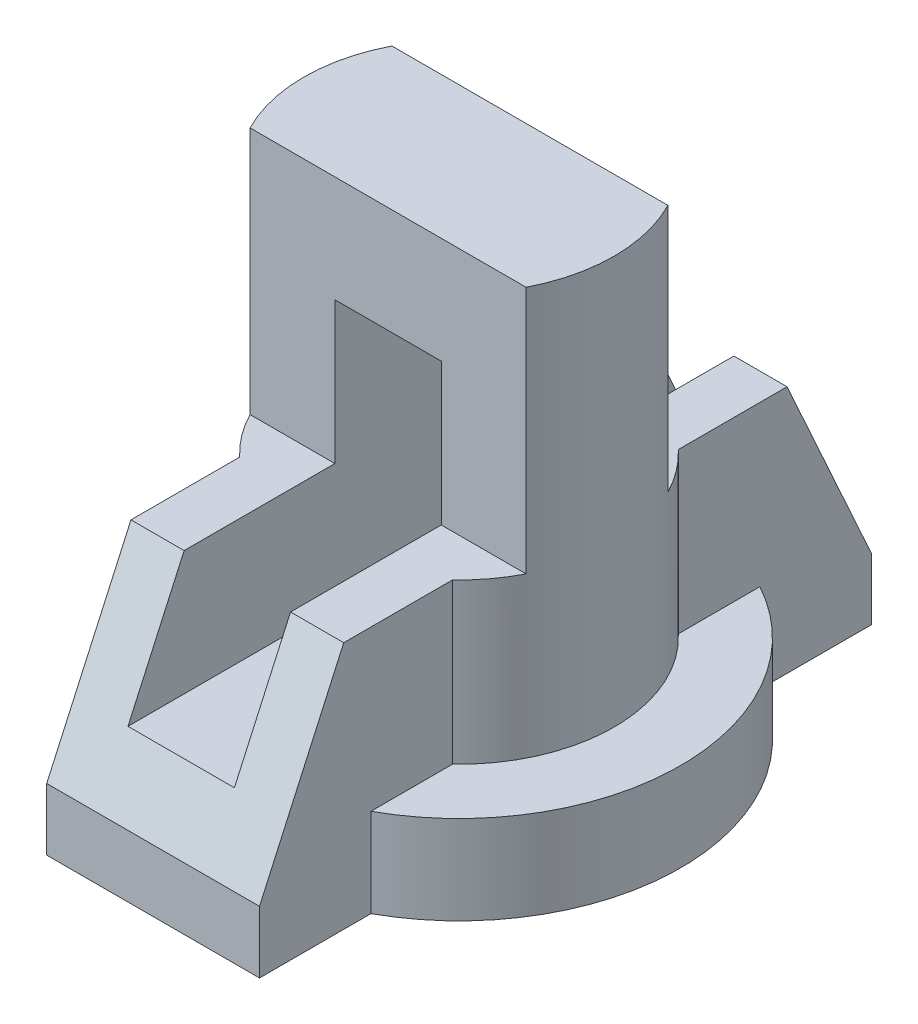
ISO-10303-21;
HEADER;
FILE_DESCRIPTION(('STEP AP214'),'2;1');
FILE_NAME('part.step','',(''),(''),'','','');
FILE_SCHEMA(('AUTOMOTIVE_DESIGN { 1 0 10303 214 1 1 1 1 }'));
ENDSEC;
DATA;
#1=APPLICATION_CONTEXT('core data for automotive mechanical design processes');
#2=APPLICATION_PROTOCOL_DEFINITION('international standard','automotive_design',2000,#1);
#3=PRODUCT_CONTEXT('',#1,'mechanical');
#4=PRODUCT('Part','Part','',(#3));
#5=PRODUCT_RELATED_PRODUCT_CATEGORY('part','',(#4));
#6=PRODUCT_DEFINITION_FORMATION('','',#4);
#7=PRODUCT_DEFINITION_CONTEXT('part definition',#1,'design');
#8=PRODUCT_DEFINITION('design','',#6,#7);
#9=PRODUCT_DEFINITION_SHAPE('','',#8);
#10=(LENGTH_UNIT() NAMED_UNIT(*) SI_UNIT(.MILLI.,.METRE.));
#11=(NAMED_UNIT(*) PLANE_ANGLE_UNIT() SI_UNIT($,.RADIAN.));
#12=(NAMED_UNIT(*) SI_UNIT($,.STERADIAN.) SOLID_ANGLE_UNIT());
#13=UNCERTAINTY_MEASURE_WITH_UNIT(LENGTH_MEASURE(1.E-05),#10,'distance_accuracy_value','');
#14=(GEOMETRIC_REPRESENTATION_CONTEXT(3) GLOBAL_UNCERTAINTY_ASSIGNED_CONTEXT((#13)) GLOBAL_UNIT_ASSIGNED_CONTEXT((#10,
#11,#12)) REPRESENTATION_CONTEXT('',''));
#15=CARTESIAN_POINT('',(0.,0.,0.));
#16=DIRECTION('',(0.,0.,1.));
#17=DIRECTION('',(1.,0.,0.));
#18=AXIS2_PLACEMENT_3D('',#15,#16,#17);
#19=CARTESIAN_POINT('',(0.,28.,0.));
#20=DIRECTION('',(0.,1.,0.));
#21=DIRECTION('',(0.,0.,1.));
#22=AXIS2_PLACEMENT_3D('',#19,#20,#21);
#23=PLANE('',#22);
#24=DIRECTION('',(0.,0.,-1.));
#25=VECTOR('',#24,1.);
#26=CARTESIAN_POINT('',(6.,28.,0.));
#27=LINE('',#26,#25);
#28=CARTESIAN_POINT('',(6.,28.,-8.));
#29=VERTEX_POINT('',#28);
#30=CARTESIAN_POINT('',(6.,28.,-25.));
#31=VERTEX_POINT('',#30);
#32=EDGE_CURVE('E356',#29,#31,#27,.T.);
#33=ORIENTED_EDGE('',*,*,#32,.F.);
#34=DIRECTION('',(-1.,0.,0.));
#35=VECTOR('',#34,1.);
#36=CARTESIAN_POINT('',(15.5643824162734,28.,-8.));
#37=LINE('',#36,#35);
#38=CARTESIAN_POINT('',(15.5643824162734,28.,-8.));
#39=VERTEX_POINT('',#38);
#40=EDGE_CURVE('E255',#39,#29,#37,.T.);
#41=ORIENTED_EDGE('',*,*,#40,.F.);
#42=CARTESIAN_POINT('',(0.,28.,0.));
#43=DIRECTION('',(0.,1.,0.));
#44=DIRECTION('',(0.,0.,1.));
#45=AXIS2_PLACEMENT_3D('',#42,#43,#44);
#46=CIRCLE('',#45,17.5);
#47=CARTESIAN_POINT('',(12.,28.,-12.737739202857));
#48=VERTEX_POINT('',#47);
#49=EDGE_CURVE('E241',#39,#48,#46,.T.);
#50=ORIENTED_EDGE('',*,*,#49,.T.);
#51=DIRECTION('',(0.,0.,1.));
#52=VECTOR('',#51,1.);
#53=CARTESIAN_POINT('',(12.,28.,25.));
#54=LINE('',#53,#52);
#55=CARTESIAN_POINT('',(12.,28.,-25.));
#56=VERTEX_POINT('',#55);
#57=EDGE_CURVE('E339',#56,#48,#54,.T.);
#58=ORIENTED_EDGE('',*,*,#57,.F.);
#59=DIRECTION('',(-1.,0.,0.));
#60=VECTOR('',#59,1.);
#61=CARTESIAN_POINT('',(12.,28.,-25.));
#62=LINE('',#61,#60);
#63=EDGE_CURVE('E304',#56,#31,#62,.T.);
#64=ORIENTED_EDGE('',*,*,#63,.T.);
#65=EDGE_LOOP('',(#33,#41,#50,#58,#64));
#66=FACE_BOUND('',#65,.T.);
#67=ADVANCED_FACE('F33',(#66),#23,.T.);
#68=DIRECTION('',(0.,0.,-1.));
#69=VECTOR('',#68,1.);
#70=CARTESIAN_POINT('',(6.,28.,0.));
#71=LINE('',#70,#69);
#72=CARTESIAN_POINT('',(6.,28.,25.));
#73=VERTEX_POINT('',#72);
#74=CARTESIAN_POINT('',(6.,28.,8.));
#75=VERTEX_POINT('',#74);
#76=EDGE_CURVE('E364',#73,#75,#71,.T.);
#77=ORIENTED_EDGE('',*,*,#76,.F.);
#78=DIRECTION('',(-1.,0.,0.));
#79=VECTOR('',#78,1.);
#80=CARTESIAN_POINT('',(12.,28.,25.));
#81=LINE('',#80,#79);
#82=CARTESIAN_POINT('',(12.,28.,25.));
#83=VERTEX_POINT('',#82);
#84=EDGE_CURVE('E308',#83,#73,#81,.T.);
#85=ORIENTED_EDGE('',*,*,#84,.F.);
#86=CARTESIAN_POINT('',(12.,28.,12.737739202857));
#87=VERTEX_POINT('',#86);
#88=EDGE_CURVE('E342',#87,#83,#54,.T.);
#89=ORIENTED_EDGE('',*,*,#88,.F.);
#90=CARTESIAN_POINT('',(15.5643824162734,28.,8.));
#91=VERTEX_POINT('',#90);
#92=EDGE_CURVE('E240',#87,#91,#46,.T.);
#93=ORIENTED_EDGE('',*,*,#92,.T.);
#94=DIRECTION('',(1.,0.,0.));
#95=VECTOR('',#94,1.);
#96=CARTESIAN_POINT('',(-15.5643824162734,28.,8.));
#97=LINE('',#96,#95);
#98=EDGE_CURVE('E263',#75,#91,#97,.T.);
#99=ORIENTED_EDGE('',*,*,#98,.F.);
#100=EDGE_LOOP('',(#77,#85,#89,#93,#99));
#101=FACE_BOUND('',#100,.T.);
#102=ADVANCED_FACE('F438',(#101),#23,.T.);
#103=CARTESIAN_POINT('',(0.,10.,0.));
#104=DIRECTION('',(0.,-1.,0.));
#105=DIRECTION('',(0.,0.,-1.));
#106=AXIS2_PLACEMENT_3D('',#103,#104,#105);
#107=CYLINDRICAL_SURFACE('',#106,25.);
#108=DIRECTION('',(0.,-1.,0.));
#109=VECTOR('',#108,1.);
#110=CARTESIAN_POINT('',(-12.,10.,21.9317121994613));
#111=LINE('',#110,#109);
#112=CARTESIAN_POINT('',(-12.,10.,21.9317121994613));
#113=VERTEX_POINT('',#112);
#114=CARTESIAN_POINT('',(-12.,0.,21.9317121994613));
#115=VERTEX_POINT('',#114);
#116=EDGE_CURVE('E283',#113,#115,#111,.T.);
#117=ORIENTED_EDGE('',*,*,#116,.F.);
#118=CARTESIAN_POINT('',(0.,10.,0.));
#119=DIRECTION('',(0.,1.,0.));
#120=DIRECTION('',(0.,0.,1.));
#121=AXIS2_PLACEMENT_3D('',#118,#119,#120);
#122=CIRCLE('',#121,25.);
#123=CARTESIAN_POINT('',(-12.,10.,-21.9317121994613));
#124=VERTEX_POINT('',#123);
#125=EDGE_CURVE('E228',#124,#113,#122,.T.);
#126=ORIENTED_EDGE('',*,*,#125,.F.);
#127=DIRECTION('',(0.,-1.,0.));
#128=VECTOR('',#127,1.);
#129=CARTESIAN_POINT('',(-12.,10.,-21.9317121994613));
#130=LINE('',#129,#128);
#131=CARTESIAN_POINT('',(-12.,0.,-21.9317121994613));
#132=VERTEX_POINT('',#131);
#133=EDGE_CURVE('E290',#132,#124,#130,.F.);
#134=ORIENTED_EDGE('',*,*,#133,.F.);
#135=CARTESIAN_POINT('',(0.,0.,0.));
#136=DIRECTION('',(0.,1.,0.));
#137=DIRECTION('',(0.,0.,1.));
#138=AXIS2_PLACEMENT_3D('',#135,#136,#137);
#139=CIRCLE('',#138,25.);
#140=EDGE_CURVE('E229',#132,#115,#139,.T.);
#141=ORIENTED_EDGE('',*,*,#140,.T.);
#142=EDGE_LOOP('',(#117,#126,#134,#141));
#143=FACE_BOUND('',#142,.T.);
#144=ADVANCED_FACE('F464',(#143),#107,.T.);
#145=CARTESIAN_POINT('',(0.,10.,0.));
#146=DIRECTION('',(0.,1.,0.));
#147=DIRECTION('',(0.,0.,1.));
#148=AXIS2_PLACEMENT_3D('',#145,#146,#147);
#149=PLANE('',#148);
#150=ORIENTED_EDGE('',*,*,#125,.T.);
#151=DIRECTION('',(0.,0.,-1.));
#152=VECTOR('',#151,1.);
#153=CARTESIAN_POINT('',(-12.,10.,0.));
#154=LINE('',#153,#152);
#155=CARTESIAN_POINT('',(-12.,10.,12.737739202857));
#156=VERTEX_POINT('',#155);
#157=EDGE_CURVE('E286',#113,#156,#154,.T.);
#158=ORIENTED_EDGE('',*,*,#157,.T.);
#159=CARTESIAN_POINT('',(0.,10.,0.));
#160=DIRECTION('',(0.,1.,0.));
#161=DIRECTION('',(0.,0.,1.));
#162=AXIS2_PLACEMENT_3D('',#159,#160,#161);
#163=CIRCLE('',#162,17.5);
#164=CARTESIAN_POINT('',(-12.,10.,-12.737739202857));
#165=VERTEX_POINT('',#164);
#166=EDGE_CURVE('E233',#165,#156,#163,.T.);
#167=ORIENTED_EDGE('',*,*,#166,.F.);
#168=EDGE_CURVE('E293',#165,#124,#154,.T.);
#169=ORIENTED_EDGE('',*,*,#168,.T.);
#170=EDGE_LOOP('',(#150,#158,#167,#169));
#171=FACE_BOUND('',#170,.T.);
#172=ADVANCED_FACE('F460',(#171),#149,.T.);
#173=CARTESIAN_POINT('',(0.,28.,0.));
#174=DIRECTION('',(0.,-1.,0.));
#175=DIRECTION('',(0.,0.,-1.));
#176=AXIS2_PLACEMENT_3D('',#173,#174,#175);
#177=CYLINDRICAL_SURFACE('',#176,17.5);
#178=DIRECTION('',(0.,-1.,0.));
#179=VECTOR('',#178,1.);
#180=CARTESIAN_POINT('',(-12.,28.,12.737739202857));
#181=LINE('',#180,#179);
#182=CARTESIAN_POINT('',(-12.,28.,12.737739202857));
#183=VERTEX_POINT('',#182);
#184=EDGE_CURVE('E287',#183,#156,#181,.T.);
#185=ORIENTED_EDGE('',*,*,#184,.F.);
#186=CARTESIAN_POINT('',(-15.5643824162734,28.,8.));
#187=VERTEX_POINT('',#186);
#188=EDGE_CURVE('E236',#187,#183,#46,.T.);
#189=ORIENTED_EDGE('',*,*,#188,.F.);
#190=DIRECTION('',(0.,-1.,0.));
#191=VECTOR('',#190,1.);
#192=CARTESIAN_POINT('',(-15.5643824162734,56.,8.));
#193=LINE('',#192,#191);
#194=CARTESIAN_POINT('',(-15.5643824162734,56.,8.));
#195=VERTEX_POINT('',#194);
#196=EDGE_CURVE('E242',#195,#187,#193,.T.);
#197=ORIENTED_EDGE('',*,*,#196,.F.);
#198=CARTESIAN_POINT('',(0.,56.,0.));
#199=DIRECTION('',(0.,1.,0.));
#200=DIRECTION('',(0.,0.,1.));
#201=AXIS2_PLACEMENT_3D('',#198,#199,#200);
#202=CIRCLE('',#201,17.5);
#203=CARTESIAN_POINT('',(-15.5643824162734,56.,-8.));
#204=VERTEX_POINT('',#203);
#205=EDGE_CURVE('E258',#204,#195,#202,.T.);
#206=ORIENTED_EDGE('',*,*,#205,.F.);
#207=DIRECTION('',(0.,-1.,0.));
#208=VECTOR('',#207,1.);
#209=CARTESIAN_POINT('',(-15.5643824162734,56.,-8.));
#210=LINE('',#209,#208);
#211=CARTESIAN_POINT('',(-15.5643824162734,28.,-8.));
#212=VERTEX_POINT('',#211);
#213=EDGE_CURVE('E251',#204,#212,#210,.T.);
#214=ORIENTED_EDGE('',*,*,#213,.T.);
#215=CARTESIAN_POINT('',(-12.,28.,-12.737739202857));
#216=VERTEX_POINT('',#215);
#217=EDGE_CURVE('E239',#216,#212,#46,.T.);
#218=ORIENTED_EDGE('',*,*,#217,.F.);
#219=DIRECTION('',(0.,-1.,0.));
#220=VECTOR('',#219,1.);
#221=CARTESIAN_POINT('',(-12.,28.,-12.737739202857));
#222=LINE('',#221,#220);
#223=EDGE_CURVE('E295',#165,#216,#222,.F.);
#224=ORIENTED_EDGE('',*,*,#223,.F.);
#225=ORIENTED_EDGE('',*,*,#166,.T.);
#226=EDGE_LOOP('',(#185,#189,#197,#206,#214,#218,#224,#225));
#227=FACE_BOUND('',#226,.T.);
#228=ADVANCED_FACE('F455',(#227),#177,.T.);
#229=DIRECTION('',(0.,0.,1.));
#230=VECTOR('',#229,1.);
#231=CARTESIAN_POINT('',(-6.,28.,0.));
#232=LINE('',#231,#230);
#233=CARTESIAN_POINT('',(-6.,28.,-25.));
#234=VERTEX_POINT('',#233);
#235=CARTESIAN_POINT('',(-6.,28.,-8.));
#236=VERTEX_POINT('',#235);
#237=EDGE_CURVE('E370',#234,#236,#232,.T.);
#238=ORIENTED_EDGE('',*,*,#237,.F.);
#239=CARTESIAN_POINT('',(-12.,28.,-25.));
#240=VERTEX_POINT('',#239);
#241=EDGE_CURVE('E307',#234,#240,#62,.T.);
#242=ORIENTED_EDGE('',*,*,#241,.T.);
#243=DIRECTION('',(0.,0.,1.));
#244=VECTOR('',#243,1.);
#245=CARTESIAN_POINT('',(-12.,28.,25.));
#246=LINE('',#245,#244);
#247=EDGE_CURVE('E323',#240,#216,#246,.T.);
#248=ORIENTED_EDGE('',*,*,#247,.T.);
#249=ORIENTED_EDGE('',*,*,#217,.T.);
#250=EDGE_CURVE('E259',#236,#212,#37,.T.);
#251=ORIENTED_EDGE('',*,*,#250,.F.);
#252=EDGE_LOOP('',(#238,#242,#248,#249,#251));
#253=FACE_BOUND('',#252,.T.);
#254=ADVANCED_FACE('F392',(#253),#23,.T.);
#255=CARTESIAN_POINT('',(12.,10.,21.9317121994613));
#256=VERTEX_POINT('',#255);
#257=CARTESIAN_POINT('',(12.,10.,-21.9317121994613));
#258=VERTEX_POINT('',#257);
#259=EDGE_CURVE('E230',#256,#258,#122,.T.);
#260=ORIENTED_EDGE('',*,*,#259,.F.);
#261=DIRECTION('',(0.,-1.,0.));
#262=VECTOR('',#261,1.);
#263=CARTESIAN_POINT('',(12.,10.,21.9317121994613));
#264=LINE('',#263,#262);
#265=CARTESIAN_POINT('',(12.,0.,21.9317121994613));
#266=VERTEX_POINT('',#265);
#267=EDGE_CURVE('E271',#256,#266,#264,.T.);
#268=ORIENTED_EDGE('',*,*,#267,.T.);
#269=CARTESIAN_POINT('',(12.,0.,-21.9317121994613));
#270=VERTEX_POINT('',#269);
#271=EDGE_CURVE('E226',#266,#270,#139,.T.);
#272=ORIENTED_EDGE('',*,*,#271,.T.);
#273=DIRECTION('',(0.,-1.,0.));
#274=VECTOR('',#273,1.);
#275=CARTESIAN_POINT('',(12.,10.,-21.9317121994613));
#276=LINE('',#275,#274);
#277=EDGE_CURVE('E276',#270,#258,#276,.F.);
#278=ORIENTED_EDGE('',*,*,#277,.T.);
#279=EDGE_LOOP('',(#260,#268,#272,#278));
#280=FACE_BOUND('',#279,.T.);
#281=ADVANCED_FACE('F35',(#280),#107,.T.);
#282=DIRECTION('',(0.,0.,-1.));
#283=VECTOR('',#282,1.);
#284=CARTESIAN_POINT('',(12.,10.,0.));
#285=LINE('',#284,#283);
#286=CARTESIAN_POINT('',(12.,10.,12.737739202857));
#287=VERTEX_POINT('',#286);
#288=EDGE_CURVE('E273',#256,#287,#285,.T.);
#289=ORIENTED_EDGE('',*,*,#288,.F.);
#290=ORIENTED_EDGE('',*,*,#259,.T.);
#291=CARTESIAN_POINT('',(12.,10.,-12.737739202857));
#292=VERTEX_POINT('',#291);
#293=EDGE_CURVE('E278',#292,#258,#285,.T.);
#294=ORIENTED_EDGE('',*,*,#293,.F.);
#295=EDGE_CURVE('E209',#287,#292,#163,.T.);
#296=ORIENTED_EDGE('',*,*,#295,.F.);
#297=EDGE_LOOP('',(#289,#290,#294,#296));
#298=FACE_BOUND('',#297,.T.);
#299=ADVANCED_FACE('F481',(#298),#149,.T.);
#300=CARTESIAN_POINT('',(0.,0.,0.));
#301=DIRECTION('',(0.,1.,0.));
#302=DIRECTION('',(0.,0.,1.));
#303=AXIS2_PLACEMENT_3D('',#300,#301,#302);
#304=PLANE('',#303);
#305=ORIENTED_EDGE('',*,*,#271,.F.);
#306=DIRECTION('',(0.,0.,-1.));
#307=VECTOR('',#306,1.);
#308=CARTESIAN_POINT('',(12.,0.,34.5));
#309=LINE('',#308,#307);
#310=CARTESIAN_POINT('',(12.,0.,34.5));
#311=VERTEX_POINT('',#310);
#312=EDGE_CURVE('E347',#311,#266,#309,.T.);
#313=ORIENTED_EDGE('',*,*,#312,.F.);
#314=DIRECTION('',(-1.,0.,0.));
#315=VECTOR('',#314,1.);
#316=CARTESIAN_POINT('',(12.,0.,34.5));
#317=LINE('',#316,#315);
#318=CARTESIAN_POINT('',(-12.,0.,34.5));
#319=VERTEX_POINT('',#318);
#320=EDGE_CURVE('E314',#311,#319,#317,.T.);
#321=ORIENTED_EDGE('',*,*,#320,.T.);
#322=DIRECTION('',(0.,0.,-1.));
#323=VECTOR('',#322,1.);
#324=CARTESIAN_POINT('',(-12.,0.,34.5));
#325=LINE('',#324,#323);
#326=EDGE_CURVE('E332',#319,#115,#325,.T.);
#327=ORIENTED_EDGE('',*,*,#326,.T.);
#328=ORIENTED_EDGE('',*,*,#140,.F.);
#329=CARTESIAN_POINT('',(-12.,0.,-34.5));
#330=VERTEX_POINT('',#329);
#331=EDGE_CURVE('E335',#132,#330,#325,.T.);
#332=ORIENTED_EDGE('',*,*,#331,.T.);
#333=DIRECTION('',(-1.,0.,0.));
#334=VECTOR('',#333,1.);
#335=CARTESIAN_POINT('',(12.,0.,-34.5));
#336=LINE('',#335,#334);
#337=CARTESIAN_POINT('',(12.,0.,-34.5));
#338=VERTEX_POINT('',#337);
#339=EDGE_CURVE('E298',#338,#330,#336,.T.);
#340=ORIENTED_EDGE('',*,*,#339,.F.);
#341=EDGE_CURVE('E320',#270,#338,#309,.T.);
#342=ORIENTED_EDGE('',*,*,#341,.F.);
#343=EDGE_LOOP('',(#305,#313,#321,#327,#328,#332,#340,#342));
#344=FACE_BOUND('',#343,.T.);
#345=ADVANCED_FACE('F426',(#344),#304,.F.);
#346=ORIENTED_EDGE('',*,*,#92,.F.);
#347=DIRECTION('',(0.,-1.,0.));
#348=VECTOR('',#347,1.);
#349=CARTESIAN_POINT('',(12.,28.,12.737739202857));
#350=LINE('',#349,#348);
#351=EDGE_CURVE('E274',#87,#287,#350,.T.);
#352=ORIENTED_EDGE('',*,*,#351,.T.);
#353=ORIENTED_EDGE('',*,*,#295,.T.);
#354=DIRECTION('',(0.,-1.,0.));
#355=VECTOR('',#354,1.);
#356=CARTESIAN_POINT('',(12.,28.,-12.737739202857));
#357=LINE('',#356,#355);
#358=EDGE_CURVE('E281',#292,#48,#357,.F.);
#359=ORIENTED_EDGE('',*,*,#358,.T.);
#360=ORIENTED_EDGE('',*,*,#49,.F.);
#361=DIRECTION('',(0.,-1.,0.));
#362=VECTOR('',#361,1.);
#363=CARTESIAN_POINT('',(15.5643824162734,56.,-8.));
#364=LINE('',#363,#362);
#365=CARTESIAN_POINT('',(15.5643824162734,56.,-8.));
#366=VERTEX_POINT('',#365);
#367=EDGE_CURVE('E248',#366,#39,#364,.T.);
#368=ORIENTED_EDGE('',*,*,#367,.F.);
#369=CARTESIAN_POINT('',(0.,56.,0.));
#370=DIRECTION('',(0.,1.,0.));
#371=DIRECTION('',(0.,0.,1.));
#372=AXIS2_PLACEMENT_3D('',#369,#370,#371);
#373=CIRCLE('',#372,17.5);
#374=CARTESIAN_POINT('',(15.5643824162734,56.,8.));
#375=VERTEX_POINT('',#374);
#376=EDGE_CURVE('E265',#375,#366,#373,.T.);
#377=ORIENTED_EDGE('',*,*,#376,.F.);
#378=DIRECTION('',(0.,-1.,0.));
#379=VECTOR('',#378,1.);
#380=CARTESIAN_POINT('',(15.5643824162734,56.,8.));
#381=LINE('',#380,#379);
#382=EDGE_CURVE('E245',#375,#91,#381,.T.);
#383=ORIENTED_EDGE('',*,*,#382,.T.);
#384=EDGE_LOOP('',(#346,#352,#353,#359,#360,#368,#377,#383));
#385=FACE_BOUND('',#384,.T.);
#386=ADVANCED_FACE('F447',(#385),#177,.T.);
#387=DIRECTION('',(0.,0.,1.));
#388=VECTOR('',#387,1.);
#389=CARTESIAN_POINT('',(-6.,28.,0.));
#390=LINE('',#389,#388);
#391=CARTESIAN_POINT('',(-6.,28.,8.));
#392=VERTEX_POINT('',#391);
#393=CARTESIAN_POINT('',(-6.,28.,25.));
#394=VERTEX_POINT('',#393);
#395=EDGE_CURVE('E54',#392,#394,#390,.T.);
#396=ORIENTED_EDGE('',*,*,#395,.F.);
#397=EDGE_CURVE('E260',#187,#392,#97,.T.);
#398=ORIENTED_EDGE('',*,*,#397,.F.);
#399=ORIENTED_EDGE('',*,*,#188,.T.);
#400=CARTESIAN_POINT('',(-12.,28.,25.));
#401=VERTEX_POINT('',#400);
#402=EDGE_CURVE('E326',#183,#401,#246,.T.);
#403=ORIENTED_EDGE('',*,*,#402,.T.);
#404=EDGE_CURVE('E310',#394,#401,#81,.T.);
#405=ORIENTED_EDGE('',*,*,#404,.F.);
#406=EDGE_LOOP('',(#396,#398,#399,#403,#405));
#407=FACE_BOUND('',#406,.T.);
#408=ADVANCED_FACE('F407',(#407),#23,.T.);
#409=CARTESIAN_POINT('',(-15.5643824162734,56.,8.));
#410=DIRECTION('',(0.,0.,-1.));
#411=DIRECTION('',(-1.,0.,0.));
#412=AXIS2_PLACEMENT_3D('',#409,#410,#411);
#413=PLANE('',#412);
#414=DIRECTION('',(1.,0.,0.));
#415=VECTOR('',#414,1.);
#416=CARTESIAN_POINT('',(-15.5643824162734,44.,8.));
#417=LINE('',#416,#415);
#418=CARTESIAN_POINT('',(-6.,44.,8.));
#419=VERTEX_POINT('',#418);
#420=CARTESIAN_POINT('',(6.,44.,8.));
#421=VERTEX_POINT('',#420);
#422=EDGE_CURVE('E350',#419,#421,#417,.T.);
#423=ORIENTED_EDGE('',*,*,#422,.T.);
#424=DIRECTION('',(0.,-1.,0.));
#425=VECTOR('',#424,1.);
#426=CARTESIAN_POINT('',(6.,56.,8.));
#427=LINE('',#426,#425);
#428=EDGE_CURVE('E361',#421,#75,#427,.T.);
#429=ORIENTED_EDGE('',*,*,#428,.T.);
#430=ORIENTED_EDGE('',*,*,#98,.T.);
#431=ORIENTED_EDGE('',*,*,#382,.F.);
#432=DIRECTION('',(1.,0.,0.));
#433=VECTOR('',#432,1.);
#434=CARTESIAN_POINT('',(-15.5643824162734,56.,8.));
#435=LINE('',#434,#433);
#436=EDGE_CURVE('E267',#195,#375,#435,.T.);
#437=ORIENTED_EDGE('',*,*,#436,.F.);
#438=ORIENTED_EDGE('',*,*,#196,.T.);
#439=ORIENTED_EDGE('',*,*,#397,.T.);
#440=DIRECTION('',(0.,1.,0.));
#441=VECTOR('',#440,1.);
#442=CARTESIAN_POINT('',(-6.,56.,8.));
#443=LINE('',#442,#441);
#444=EDGE_CURVE('E374',#392,#419,#443,.T.);
#445=ORIENTED_EDGE('',*,*,#444,.T.);
#446=EDGE_LOOP('',(#423,#429,#430,#431,#437,#438,#439,#445));
#447=FACE_BOUND('',#446,.T.);
#448=ADVANCED_FACE('F404',(#447),#413,.F.);
#449=CARTESIAN_POINT('',(15.5643824162734,56.,-8.));
#450=DIRECTION('',(0.,0.,1.));
#451=DIRECTION('',(1.,0.,0.));
#452=AXIS2_PLACEMENT_3D('',#449,#450,#451);
#453=PLANE('',#452);
#454=ORIENTED_EDGE('',*,*,#40,.T.);
#455=DIRECTION('',(0.,1.,0.));
#456=VECTOR('',#455,1.);
#457=CARTESIAN_POINT('',(6.,56.,-8.));
#458=LINE('',#457,#456);
#459=CARTESIAN_POINT('',(6.,44.,-8.));
#460=VERTEX_POINT('',#459);
#461=EDGE_CURVE('E353',#29,#460,#458,.T.);
#462=ORIENTED_EDGE('',*,*,#461,.T.);
#463=DIRECTION('',(-1.,0.,0.));
#464=VECTOR('',#463,1.);
#465=CARTESIAN_POINT('',(15.5643824162734,44.,-8.));
#466=LINE('',#465,#464);
#467=CARTESIAN_POINT('',(-6.,44.,-8.));
#468=VERTEX_POINT('',#467);
#469=EDGE_CURVE('E11',#460,#468,#466,.T.);
#470=ORIENTED_EDGE('',*,*,#469,.T.);
#471=DIRECTION('',(0.,-1.,0.));
#472=VECTOR('',#471,1.);
#473=CARTESIAN_POINT('',(-6.,56.,-8.));
#474=LINE('',#473,#472);
#475=EDGE_CURVE('E367',#468,#236,#474,.T.);
#476=ORIENTED_EDGE('',*,*,#475,.T.);
#477=ORIENTED_EDGE('',*,*,#250,.T.);
#478=ORIENTED_EDGE('',*,*,#213,.F.);
#479=DIRECTION('',(-1.,0.,0.));
#480=VECTOR('',#479,1.);
#481=CARTESIAN_POINT('',(15.5643824162734,56.,-8.));
#482=LINE('',#481,#480);
#483=EDGE_CURVE('E254',#366,#204,#482,.T.);
#484=ORIENTED_EDGE('',*,*,#483,.F.);
#485=ORIENTED_EDGE('',*,*,#367,.T.);
#486=EDGE_LOOP('',(#454,#462,#470,#476,#477,#478,#484,#485));
#487=FACE_BOUND('',#486,.T.);
#488=ADVANCED_FACE('F396',(#487),#453,.F.);
#489=CARTESIAN_POINT('',(0.,56.,0.));
#490=DIRECTION('',(0.,1.,0.));
#491=DIRECTION('',(0.,0.,1.));
#492=AXIS2_PLACEMENT_3D('',#489,#490,#491);
#493=PLANE('',#492);
#494=ORIENTED_EDGE('',*,*,#205,.T.);
#495=ORIENTED_EDGE('',*,*,#436,.T.);
#496=ORIENTED_EDGE('',*,*,#376,.T.);
#497=ORIENTED_EDGE('',*,*,#483,.T.);
#498=EDGE_LOOP('',(#494,#495,#496,#497));
#499=FACE_BOUND('',#498,.T.);
#500=ADVANCED_FACE('F453',(#499),#493,.T.);
#501=CARTESIAN_POINT('',(12.,0.,-34.5));
#502=DIRECTION('',(0.,0.,1.));
#503=DIRECTION('',(1.,0.,0.));
#504=AXIS2_PLACEMENT_3D('',#501,#502,#503);
#505=PLANE('',#504);
#506=DIRECTION('',(0.,1.,0.));
#507=VECTOR('',#506,1.);
#508=CARTESIAN_POINT('',(-12.,0.,-34.5));
#509=LINE('',#508,#507);
#510=CARTESIAN_POINT('',(-12.,7.00000000000001,-34.5));
#511=VERTEX_POINT('',#510);
#512=EDGE_CURVE('E330',#330,#511,#509,.T.);
#513=ORIENTED_EDGE('',*,*,#512,.T.);
#514=DIRECTION('',(-1.,0.,0.));
#515=VECTOR('',#514,1.);
#516=CARTESIAN_POINT('',(12.,7.00000000000001,-34.5));
#517=LINE('',#516,#515);
#518=CARTESIAN_POINT('',(12.,7.00000000000001,-34.5));
#519=VERTEX_POINT('',#518);
#520=EDGE_CURVE('E301',#519,#511,#517,.T.);
#521=ORIENTED_EDGE('',*,*,#520,.F.);
#522=DIRECTION('',(0.,1.,0.));
#523=VECTOR('',#522,1.);
#524=CARTESIAN_POINT('',(12.,0.,-34.5));
#525=LINE('',#524,#523);
#526=EDGE_CURVE('E345',#338,#519,#525,.T.);
#527=ORIENTED_EDGE('',*,*,#526,.F.);
#528=ORIENTED_EDGE('',*,*,#339,.T.);
#529=EDGE_LOOP('',(#513,#521,#527,#528));
#530=FACE_BOUND('',#529,.T.);
#531=ADVANCED_FACE('F472',(#530),#505,.F.);
#532=CARTESIAN_POINT('',(12.,7.00000000000001,-34.5));
#533=DIRECTION('',(0.,-0.412167869855447,0.911107922838356));
#534=DIRECTION('',(0.,-0.911107922838356,-0.412167869855447));
#535=AXIS2_PLACEMENT_3D('',#532,#533,#534);
#536=PLANE('',#535);
#537=DIRECTION('',(1.,0.,0.));
#538=VECTOR('',#537,1.);
#539=CARTESIAN_POINT('',(12.,14.,-31.3333333333333));
#540=LINE('',#539,#538);
#541=CARTESIAN_POINT('',(-6.,14.,-31.3333333333333));
#542=VERTEX_POINT('',#541);
#543=CARTESIAN_POINT('',(6.,14.,-31.3333333333333));
#544=VERTEX_POINT('',#543);
#545=EDGE_CURVE('E216',#542,#544,#540,.T.);
#546=ORIENTED_EDGE('',*,*,#545,.T.);
#547=DIRECTION('',(0.,0.911107922838356,0.412167869855447));
#548=VECTOR('',#547,1.);
#549=CARTESIAN_POINT('',(6.,7.00000000000001,-34.5));
#550=LINE('',#549,#548);
#551=EDGE_CURVE('E358',#544,#31,#550,.T.);
#552=ORIENTED_EDGE('',*,*,#551,.T.);
#553=ORIENTED_EDGE('',*,*,#63,.F.);
#554=DIRECTION('',(0.,0.911107922838356,0.412167869855447));
#555=VECTOR('',#554,1.);
#556=CARTESIAN_POINT('',(12.,7.00000000000001,-34.5));
#557=LINE('',#556,#555);
#558=EDGE_CURVE('E343',#519,#56,#557,.T.);
#559=ORIENTED_EDGE('',*,*,#558,.F.);
#560=ORIENTED_EDGE('',*,*,#520,.T.);
#561=DIRECTION('',(0.,0.911107922838356,0.412167869855447));
#562=VECTOR('',#561,1.);
#563=CARTESIAN_POINT('',(-12.,7.00000000000001,-34.5));
#564=LINE('',#563,#562);
#565=EDGE_CURVE('E327',#511,#240,#564,.T.);
#566=ORIENTED_EDGE('',*,*,#565,.T.);
#567=ORIENTED_EDGE('',*,*,#241,.F.);
#568=DIRECTION('',(0.,-0.911107922838356,-0.412167869855447));
#569=VECTOR('',#568,1.);
#570=CARTESIAN_POINT('',(-6.,7.00000000000001,-34.5));
#571=LINE('',#570,#569);
#572=EDGE_CURVE('E372',#234,#542,#571,.T.);
#573=ORIENTED_EDGE('',*,*,#572,.T.);
#574=EDGE_LOOP('',(#546,#552,#553,#559,#560,#566,#567,#573));
#575=FACE_BOUND('',#574,.T.);
#576=ADVANCED_FACE('F386',(#575),#536,.F.);
#577=CARTESIAN_POINT('',(12.,0.,0.));
#578=DIRECTION('',(1.,0.,0.));
#579=DIRECTION('',(0.,0.,-1.));
#580=AXIS2_PLACEMENT_3D('',#577,#578,#579);
#581=PLANE('',#580);
#582=ORIENTED_EDGE('',*,*,#277,.F.);
#583=ORIENTED_EDGE('',*,*,#341,.T.);
#584=ORIENTED_EDGE('',*,*,#526,.T.);
#585=ORIENTED_EDGE('',*,*,#558,.T.);
#586=ORIENTED_EDGE('',*,*,#57,.T.);
#587=ORIENTED_EDGE('',*,*,#358,.F.);
#588=ORIENTED_EDGE('',*,*,#293,.T.);
#589=EDGE_LOOP('',(#582,#583,#584,#585,#586,#587,#588));
#590=FACE_BOUND('',#589,.T.);
#591=ADVANCED_FACE('F477',(#590),#581,.T.);
#592=CARTESIAN_POINT('',(-12.,0.,0.));
#593=DIRECTION('',(1.,0.,0.));
#594=DIRECTION('',(0.,0.,-1.));
#595=AXIS2_PLACEMENT_3D('',#592,#593,#594);
#596=PLANE('',#595);
#597=ORIENTED_EDGE('',*,*,#331,.F.);
#598=ORIENTED_EDGE('',*,*,#133,.T.);
#599=ORIENTED_EDGE('',*,*,#168,.F.);
#600=ORIENTED_EDGE('',*,*,#223,.T.);
#601=ORIENTED_EDGE('',*,*,#247,.F.);
#602=ORIENTED_EDGE('',*,*,#565,.F.);
#603=ORIENTED_EDGE('',*,*,#512,.F.);
#604=EDGE_LOOP('',(#597,#598,#599,#600,#601,#602,#603));
#605=FACE_BOUND('',#604,.T.);
#606=ADVANCED_FACE('F466',(#605),#596,.F.);
#607=ORIENTED_EDGE('',*,*,#267,.F.);
#608=ORIENTED_EDGE('',*,*,#288,.T.);
#609=ORIENTED_EDGE('',*,*,#351,.F.);
#610=ORIENTED_EDGE('',*,*,#88,.T.);
#611=DIRECTION('',(0.,-0.911107922838356,0.412167869855447));
#612=VECTOR('',#611,1.);
#613=CARTESIAN_POINT('',(12.,7.,34.5));
#614=LINE('',#613,#612);
#615=CARTESIAN_POINT('',(12.,7.,34.5));
#616=VERTEX_POINT('',#615);
#617=EDGE_CURVE('E337',#83,#616,#614,.T.);
#618=ORIENTED_EDGE('',*,*,#617,.T.);
#619=DIRECTION('',(0.,-1.,0.));
#620=VECTOR('',#619,1.);
#621=CARTESIAN_POINT('',(12.,0.,34.5));
#622=LINE('',#621,#620);
#623=EDGE_CURVE('E317',#616,#311,#622,.T.);
#624=ORIENTED_EDGE('',*,*,#623,.T.);
#625=ORIENTED_EDGE('',*,*,#312,.T.);
#626=EDGE_LOOP('',(#607,#608,#609,#610,#618,#624,#625));
#627=FACE_BOUND('',#626,.T.);
#628=ADVANCED_FACE('F432',(#627),#581,.T.);
#629=ORIENTED_EDGE('',*,*,#157,.F.);
#630=ORIENTED_EDGE('',*,*,#116,.T.);
#631=ORIENTED_EDGE('',*,*,#326,.F.);
#632=DIRECTION('',(0.,-1.,0.));
#633=VECTOR('',#632,1.);
#634=CARTESIAN_POINT('',(-12.,0.,34.5));
#635=LINE('',#634,#633);
#636=CARTESIAN_POINT('',(-12.,7.,34.5));
#637=VERTEX_POINT('',#636);
#638=EDGE_CURVE('E318',#637,#319,#635,.T.);
#639=ORIENTED_EDGE('',*,*,#638,.F.);
#640=DIRECTION('',(0.,-0.911107922838356,0.412167869855447));
#641=VECTOR('',#640,1.);
#642=CARTESIAN_POINT('',(-12.,7.,34.5));
#643=LINE('',#642,#641);
#644=EDGE_CURVE('E321',#401,#637,#643,.T.);
#645=ORIENTED_EDGE('',*,*,#644,.F.);
#646=ORIENTED_EDGE('',*,*,#402,.F.);
#647=ORIENTED_EDGE('',*,*,#184,.T.);
#648=EDGE_LOOP('',(#629,#630,#631,#639,#645,#646,#647));
#649=FACE_BOUND('',#648,.T.);
#650=ADVANCED_FACE('F422',(#649),#596,.F.);
#651=CARTESIAN_POINT('',(12.,7.,34.5));
#652=DIRECTION('',(0.,-0.412167869855447,-0.911107922838356));
#653=DIRECTION('',(0.,0.911107922838356,-0.412167869855447));
#654=AXIS2_PLACEMENT_3D('',#651,#652,#653);
#655=PLANE('',#654);
#656=ORIENTED_EDGE('',*,*,#84,.T.);
#657=DIRECTION('',(0.,-0.911107922838356,0.412167869855447));
#658=VECTOR('',#657,1.);
#659=CARTESIAN_POINT('',(6.,7.,34.5));
#660=LINE('',#659,#658);
#661=CARTESIAN_POINT('',(6.,14.,31.3333333333333));
#662=VERTEX_POINT('',#661);
#663=EDGE_CURVE('E41',#73,#662,#660,.T.);
#664=ORIENTED_EDGE('',*,*,#663,.T.);
#665=DIRECTION('',(-1.,0.,0.));
#666=VECTOR('',#665,1.);
#667=CARTESIAN_POINT('',(12.,14.,31.3333333333333));
#668=LINE('',#667,#666);
#669=CARTESIAN_POINT('',(-6.,14.,31.3333333333333));
#670=VERTEX_POINT('',#669);
#671=EDGE_CURVE('E208',#662,#670,#668,.T.);
#672=ORIENTED_EDGE('',*,*,#671,.T.);
#673=DIRECTION('',(0.,0.911107922838356,-0.412167869855447));
#674=VECTOR('',#673,1.);
#675=CARTESIAN_POINT('',(-6.,7.,34.5));
#676=LINE('',#675,#674);
#677=EDGE_CURVE('E202',#670,#394,#676,.T.);
#678=ORIENTED_EDGE('',*,*,#677,.T.);
#679=ORIENTED_EDGE('',*,*,#404,.T.);
#680=ORIENTED_EDGE('',*,*,#644,.T.);
#681=DIRECTION('',(-1.,0.,0.));
#682=VECTOR('',#681,1.);
#683=CARTESIAN_POINT('',(12.,7.,34.5));
#684=LINE('',#683,#682);
#685=EDGE_CURVE('E311',#616,#637,#684,.T.);
#686=ORIENTED_EDGE('',*,*,#685,.F.);
#687=ORIENTED_EDGE('',*,*,#617,.F.);
#688=EDGE_LOOP('',(#656,#664,#672,#678,#679,#680,#686,#687));
#689=FACE_BOUND('',#688,.T.);
#690=ADVANCED_FACE('F223',(#689),#655,.F.);
#691=CARTESIAN_POINT('',(12.,0.,34.5));
#692=DIRECTION('',(0.,0.,-1.));
#693=DIRECTION('',(-1.,0.,0.));
#694=AXIS2_PLACEMENT_3D('',#691,#692,#693);
#695=PLANE('',#694);
#696=ORIENTED_EDGE('',*,*,#638,.T.);
#697=ORIENTED_EDGE('',*,*,#320,.F.);
#698=ORIENTED_EDGE('',*,*,#623,.F.);
#699=ORIENTED_EDGE('',*,*,#685,.T.);
#700=EDGE_LOOP('',(#696,#697,#698,#699));
#701=FACE_BOUND('',#700,.T.);
#702=ADVANCED_FACE('F418',(#701),#695,.F.);
#703=CARTESIAN_POINT('',(-6.,44.,-34.5));
#704=DIRECTION('',(0.,1.,0.));
#705=DIRECTION('',(0.,0.,1.));
#706=AXIS2_PLACEMENT_3D('',#703,#704,#705);
#707=PLANE('',#706);
#708=DIRECTION('',(0.,0.,1.));
#709=VECTOR('',#708,1.);
#710=CARTESIAN_POINT('',(-6.,44.,-34.5));
#711=LINE('',#710,#709);
#712=EDGE_CURVE('E219',#468,#419,#711,.T.);
#713=ORIENTED_EDGE('',*,*,#712,.F.);
#714=ORIENTED_EDGE('',*,*,#469,.F.);
#715=DIRECTION('',(0.,0.,1.));
#716=VECTOR('',#715,1.);
#717=CARTESIAN_POINT('',(6.,44.,-34.5));
#718=LINE('',#717,#716);
#719=EDGE_CURVE('E378',#460,#421,#718,.T.);
#720=ORIENTED_EDGE('',*,*,#719,.T.);
#721=ORIENTED_EDGE('',*,*,#422,.F.);
#722=EDGE_LOOP('',(#713,#714,#720,#721));
#723=FACE_BOUND('',#722,.T.);
#724=ADVANCED_FACE('F401',(#723),#707,.F.);
#725=CARTESIAN_POINT('',(6.,14.,-34.5));
#726=DIRECTION('',(1.,0.,0.));
#727=DIRECTION('',(0.,0.,-1.));
#728=AXIS2_PLACEMENT_3D('',#725,#726,#727);
#729=PLANE('',#728);
#730=ORIENTED_EDGE('',*,*,#32,.T.);
#731=ORIENTED_EDGE('',*,*,#551,.F.);
#732=DIRECTION('',(0.,0.,1.));
#733=VECTOR('',#732,1.);
#734=CARTESIAN_POINT('',(6.,14.,-34.5));
#735=LINE('',#734,#733);
#736=EDGE_CURVE('E218',#544,#662,#735,.T.);
#737=ORIENTED_EDGE('',*,*,#736,.T.);
#738=ORIENTED_EDGE('',*,*,#663,.F.);
#739=ORIENTED_EDGE('',*,*,#76,.T.);
#740=ORIENTED_EDGE('',*,*,#428,.F.);
#741=ORIENTED_EDGE('',*,*,#719,.F.);
#742=ORIENTED_EDGE('',*,*,#461,.F.);
#743=EDGE_LOOP('',(#730,#731,#737,#738,#739,#740,#741,#742));
#744=FACE_BOUND('',#743,.T.);
#745=ADVANCED_FACE('F383',(#744),#729,.F.);
#746=CARTESIAN_POINT('',(-6.,14.,-34.5));
#747=DIRECTION('',(0.,-1.,0.));
#748=DIRECTION('',(0.,0.,-1.));
#749=AXIS2_PLACEMENT_3D('',#746,#747,#748);
#750=PLANE('',#749);
#751=DIRECTION('',(0.,0.,1.));
#752=VECTOR('',#751,1.);
#753=CARTESIAN_POINT('',(-6.,14.,-34.5));
#754=LINE('',#753,#752);
#755=EDGE_CURVE('E48',#542,#670,#754,.T.);
#756=ORIENTED_EDGE('',*,*,#755,.T.);
#757=ORIENTED_EDGE('',*,*,#671,.F.);
#758=ORIENTED_EDGE('',*,*,#736,.F.);
#759=ORIENTED_EDGE('',*,*,#545,.F.);
#760=EDGE_LOOP('',(#756,#757,#758,#759));
#761=FACE_BOUND('',#760,.T.);
#762=ADVANCED_FACE('F212',(#761),#750,.F.);
#763=CARTESIAN_POINT('',(-6.,14.,-34.5));
#764=DIRECTION('',(-1.,0.,0.));
#765=DIRECTION('',(0.,0.,1.));
#766=AXIS2_PLACEMENT_3D('',#763,#764,#765);
#767=PLANE('',#766);
#768=ORIENTED_EDGE('',*,*,#712,.T.);
#769=ORIENTED_EDGE('',*,*,#444,.F.);
#770=ORIENTED_EDGE('',*,*,#395,.T.);
#771=ORIENTED_EDGE('',*,*,#677,.F.);
#772=ORIENTED_EDGE('',*,*,#755,.F.);
#773=ORIENTED_EDGE('',*,*,#572,.F.);
#774=ORIENTED_EDGE('',*,*,#237,.T.);
#775=ORIENTED_EDGE('',*,*,#475,.F.);
#776=EDGE_LOOP('',(#768,#769,#770,#771,#772,#773,#774,#775));
#777=FACE_BOUND('',#776,.T.);
#778=ADVANCED_FACE('F204',(#777),#767,.F.);
#779=CLOSED_SHELL('',(#67,#102,#144,#172,#228,#254,#281,#299,#345,#386,#408,#448,#488,#500,#531,
#576,#591,#606,#628,#650,#690,#702,#724,#745,#762,#778));
#780=MANIFOLD_SOLID_BREP('B2',#779);
#781=ADVANCED_BREP_SHAPE_REPRESENTATION('',(#18,#780),#14);
#782=SHAPE_DEFINITION_REPRESENTATION(#9,#781);
ENDSEC;
END-ISO-10303-21;
